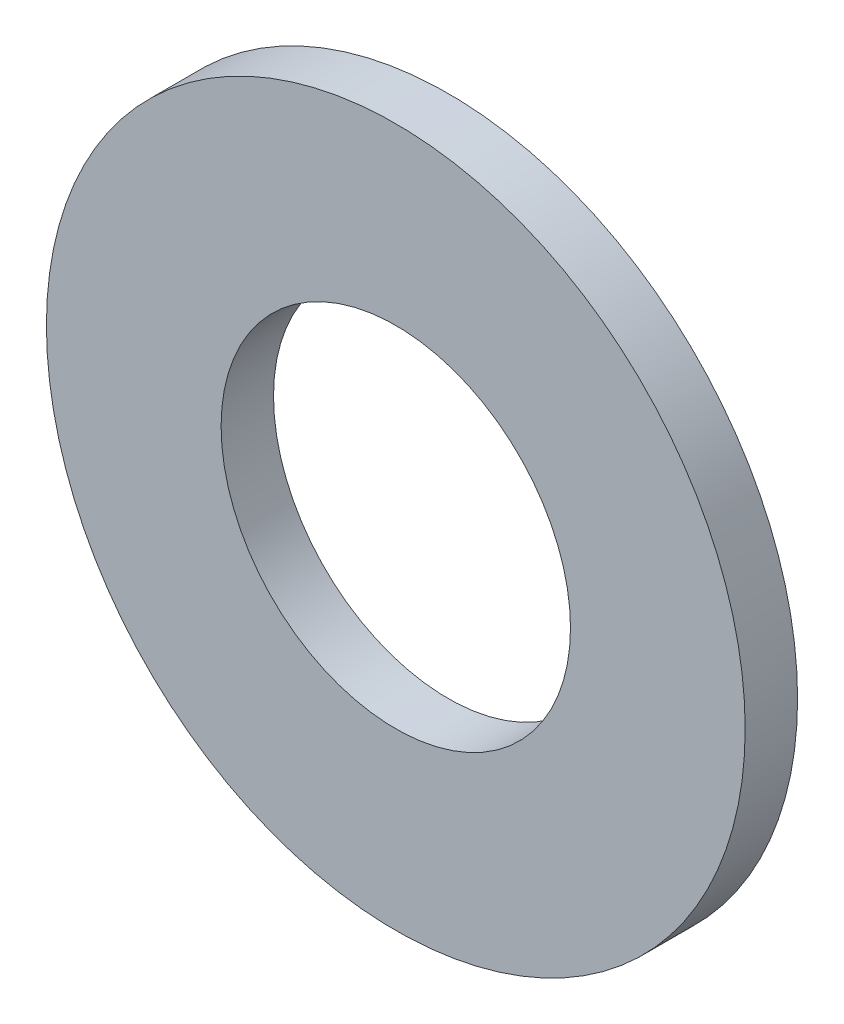
ISO-10303-21;
HEADER;
FILE_DESCRIPTION(('STEP AP214'),'2;1');
FILE_NAME('part.step','',(''),(''),'','','');
FILE_SCHEMA(('AUTOMOTIVE_DESIGN { 1 0 10303 214 1 1 1 1 }'));
ENDSEC;
DATA;
#1=APPLICATION_CONTEXT('core data for automotive mechanical design processes');
#2=APPLICATION_PROTOCOL_DEFINITION('international standard','automotive_design',2000,#1);
#3=PRODUCT_CONTEXT('',#1,'mechanical');
#4=PRODUCT('Part','Part','',(#3));
#5=PRODUCT_RELATED_PRODUCT_CATEGORY('part','',(#4));
#6=PRODUCT_DEFINITION_FORMATION('','',#4);
#7=PRODUCT_DEFINITION_CONTEXT('part definition',#1,'design');
#8=PRODUCT_DEFINITION('design','',#6,#7);
#9=PRODUCT_DEFINITION_SHAPE('','',#8);
#10=(LENGTH_UNIT() NAMED_UNIT(*) SI_UNIT(.MILLI.,.METRE.));
#11=(NAMED_UNIT(*) PLANE_ANGLE_UNIT() SI_UNIT($,.RADIAN.));
#12=(NAMED_UNIT(*) SI_UNIT($,.STERADIAN.) SOLID_ANGLE_UNIT());
#13=UNCERTAINTY_MEASURE_WITH_UNIT(LENGTH_MEASURE(1.E-05),#10,'distance_accuracy_value','');
#14=(GEOMETRIC_REPRESENTATION_CONTEXT(3) GLOBAL_UNCERTAINTY_ASSIGNED_CONTEXT((#13)) GLOBAL_UNIT_ASSIGNED_CONTEXT((#10,
#11,#12)) REPRESENTATION_CONTEXT('',''));
#15=CARTESIAN_POINT('',(0.,0.,0.));
#16=DIRECTION('',(0.,0.,1.));
#17=DIRECTION('',(1.,0.,0.));
#18=AXIS2_PLACEMENT_3D('',#15,#16,#17);
#19=CARTESIAN_POINT('',(0.,0.,0.6));
#20=DIRECTION('',(0.,0.,1.));
#21=DIRECTION('',(1.,0.,0.));
#22=AXIS2_PLACEMENT_3D('',#19,#20,#21);
#23=PLANE('',#22);
#24=CARTESIAN_POINT('',(0.,0.,0.6));
#25=DIRECTION('',(0.,0.,1.));
#26=DIRECTION('',(1.,0.,0.));
#27=AXIS2_PLACEMENT_3D('',#24,#25,#26);
#28=CIRCLE('',#27,4.);
#29=CARTESIAN_POINT('',(4.,0.,0.6));
#30=VERTEX_POINT('',#29);
#31=EDGE_CURVE('E10',#30,#30,#28,.T.);
#32=ORIENTED_EDGE('',*,*,#31,.T.);
#33=EDGE_LOOP('',(#32));
#34=FACE_BOUND('',#33,.T.);
#35=CARTESIAN_POINT('',(0.,0.,0.6));
#36=DIRECTION('',(0.,0.,1.));
#37=DIRECTION('',(1.,0.,0.));
#38=AXIS2_PLACEMENT_3D('',#35,#36,#37);
#39=CIRCLE('',#38,2.);
#40=CARTESIAN_POINT('',(2.,0.,0.6));
#41=VERTEX_POINT('',#40);
#42=EDGE_CURVE('E50',#41,#41,#39,.T.);
#43=ORIENTED_EDGE('',*,*,#42,.F.);
#44=EDGE_LOOP('',(#43));
#45=FACE_BOUND('',#44,.T.);
#46=ADVANCED_FACE('F37',(#34,#45),#23,.T.);
#47=CARTESIAN_POINT('',(0.,0.,0.));
#48=DIRECTION('',(0.,0.,1.));
#49=DIRECTION('',(1.,0.,0.));
#50=AXIS2_PLACEMENT_3D('',#47,#48,#49);
#51=PLANE('',#50);
#52=CARTESIAN_POINT('',(0.,0.,0.));
#53=DIRECTION('',(0.,0.,1.));
#54=DIRECTION('',(1.,0.,0.));
#55=AXIS2_PLACEMENT_3D('',#52,#53,#54);
#56=CIRCLE('',#55,4.);
#57=CARTESIAN_POINT('',(4.,0.,0.));
#58=VERTEX_POINT('',#57);
#59=EDGE_CURVE('E41',#58,#58,#56,.T.);
#60=ORIENTED_EDGE('',*,*,#59,.F.);
#61=EDGE_LOOP('',(#60));
#62=FACE_BOUND('',#61,.T.);
#63=CARTESIAN_POINT('',(0.,0.,0.));
#64=DIRECTION('',(0.,0.,1.));
#65=DIRECTION('',(1.,0.,0.));
#66=AXIS2_PLACEMENT_3D('',#63,#64,#65);
#67=CIRCLE('',#66,2.);
#68=CARTESIAN_POINT('',(2.,0.,0.));
#69=VERTEX_POINT('',#68);
#70=EDGE_CURVE('E52',#69,#69,#67,.T.);
#71=ORIENTED_EDGE('',*,*,#70,.T.);
#72=EDGE_LOOP('',(#71));
#73=FACE_BOUND('',#72,.T.);
#74=ADVANCED_FACE('F64',(#62,#73),#51,.F.);
#75=CARTESIAN_POINT('',(0.,0.,0.6));
#76=DIRECTION('',(0.,0.,-1.));
#77=DIRECTION('',(-1.,0.,0.));
#78=AXIS2_PLACEMENT_3D('',#75,#76,#77);
#79=CYLINDRICAL_SURFACE('',#78,4.);
#80=ORIENTED_EDGE('',*,*,#31,.F.);
#81=EDGE_LOOP('',(#80));
#82=FACE_BOUND('',#81,.T.);
#83=ORIENTED_EDGE('',*,*,#59,.T.);
#84=EDGE_LOOP('',(#83));
#85=FACE_BOUND('',#84,.T.);
#86=ADVANCED_FACE('F39',(#82,#85),#79,.T.);
#87=CARTESIAN_POINT('',(0.,0.,0.6));
#88=DIRECTION('',(0.,0.,-1.));
#89=DIRECTION('',(-1.,0.,0.));
#90=AXIS2_PLACEMENT_3D('',#87,#88,#89);
#91=CYLINDRICAL_SURFACE('',#90,2.);
#92=ORIENTED_EDGE('',*,*,#42,.T.);
#93=EDGE_LOOP('',(#92));
#94=FACE_BOUND('',#93,.T.);
#95=ORIENTED_EDGE('',*,*,#70,.F.);
#96=EDGE_LOOP('',(#95));
#97=FACE_BOUND('',#96,.T.);
#98=ADVANCED_FACE('F60',(#94,#97),#91,.F.);
#99=CLOSED_SHELL('',(#46,#74,#86,#98));
#100=MANIFOLD_SOLID_BREP('B2',#99);
#101=ADVANCED_BREP_SHAPE_REPRESENTATION('',(#18,#100),#14);
#102=SHAPE_DEFINITION_REPRESENTATION(#9,#101);
ENDSEC;
END-ISO-10303-21;
